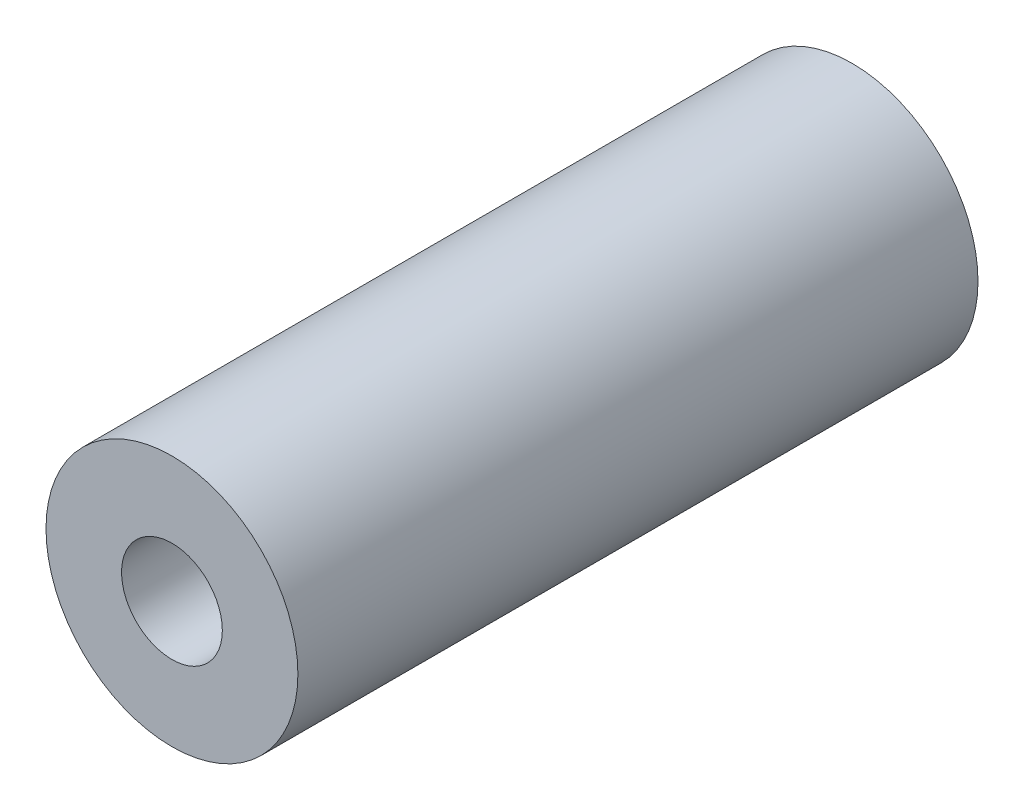
ISO-10303-21;
HEADER;
FILE_DESCRIPTION(('STEP AP214'),'2;1');
FILE_NAME('part.step','',(''),(''),'','','');
FILE_SCHEMA(('AUTOMOTIVE_DESIGN { 1 0 10303 214 1 1 1 1 }'));
ENDSEC;
DATA;
#1=APPLICATION_CONTEXT('core data for automotive mechanical design processes');
#2=APPLICATION_PROTOCOL_DEFINITION('international standard','automotive_design',2000,#1);
#3=PRODUCT_CONTEXT('',#1,'mechanical');
#4=PRODUCT('Part','Part','',(#3));
#5=PRODUCT_RELATED_PRODUCT_CATEGORY('part','',(#4));
#6=PRODUCT_DEFINITION_FORMATION('','',#4);
#7=PRODUCT_DEFINITION_CONTEXT('part definition',#1,'design');
#8=PRODUCT_DEFINITION('design','',#6,#7);
#9=PRODUCT_DEFINITION_SHAPE('','',#8);
#10=(LENGTH_UNIT() NAMED_UNIT(*) SI_UNIT(.MILLI.,.METRE.));
#11=(NAMED_UNIT(*) PLANE_ANGLE_UNIT() SI_UNIT($,.RADIAN.));
#12=(NAMED_UNIT(*) SI_UNIT($,.STERADIAN.) SOLID_ANGLE_UNIT());
#13=UNCERTAINTY_MEASURE_WITH_UNIT(LENGTH_MEASURE(1.E-05),#10,'distance_accuracy_value','');
#14=(GEOMETRIC_REPRESENTATION_CONTEXT(3) GLOBAL_UNCERTAINTY_ASSIGNED_CONTEXT((#13)) GLOBAL_UNIT_ASSIGNED_CONTEXT((#10,
#11,#12)) REPRESENTATION_CONTEXT('',''));
#15=CARTESIAN_POINT('',(0.,0.,0.));
#16=DIRECTION('',(0.,0.,1.));
#17=DIRECTION('',(1.,0.,0.));
#18=AXIS2_PLACEMENT_3D('',#15,#16,#17);
#19=CARTESIAN_POINT('',(0.,0.,54.));
#20=DIRECTION('',(0.,0.,-1.));
#21=DIRECTION('',(-1.,0.,0.));
#22=AXIS2_PLACEMENT_3D('',#19,#20,#21);
#23=CYLINDRICAL_SURFACE('',#22,10.);
#24=CARTESIAN_POINT('',(0.,0.,54.));
#25=DIRECTION('',(0.,0.,1.));
#26=DIRECTION('',(1.,0.,0.));
#27=AXIS2_PLACEMENT_3D('',#24,#25,#26);
#28=CIRCLE('',#27,10.);
#29=CARTESIAN_POINT('',(10.,0.,54.));
#30=VERTEX_POINT('',#29);
#31=EDGE_CURVE('E10',#30,#30,#28,.T.);
#32=ORIENTED_EDGE('',*,*,#31,.F.);
#33=EDGE_LOOP('',(#32));
#34=FACE_BOUND('',#33,.T.);
#35=CARTESIAN_POINT('',(0.,0.,0.));
#36=DIRECTION('',(0.,0.,1.));
#37=DIRECTION('',(1.,0.,0.));
#38=AXIS2_PLACEMENT_3D('',#35,#36,#37);
#39=CIRCLE('',#38,10.);
#40=CARTESIAN_POINT('',(10.,0.,0.));
#41=VERTEX_POINT('',#40);
#42=EDGE_CURVE('E40',#41,#41,#39,.T.);
#43=ORIENTED_EDGE('',*,*,#42,.T.);
#44=EDGE_LOOP('',(#43));
#45=FACE_BOUND('',#44,.T.);
#46=ADVANCED_FACE('F37',(#34,#45),#23,.T.);
#47=CARTESIAN_POINT('',(0.,0.,54.));
#48=DIRECTION('',(0.,0.,1.));
#49=DIRECTION('',(1.,0.,0.));
#50=AXIS2_PLACEMENT_3D('',#47,#48,#49);
#51=PLANE('',#50);
#52=CARTESIAN_POINT('',(0.,0.,54.));
#53=DIRECTION('',(0.,0.,1.));
#54=DIRECTION('',(1.,0.,0.));
#55=AXIS2_PLACEMENT_3D('',#52,#53,#54);
#56=CIRCLE('',#55,4.);
#57=CARTESIAN_POINT('',(4.,0.,54.));
#58=VERTEX_POINT('',#57);
#59=EDGE_CURVE('E51',#58,#58,#56,.T.);
#60=ORIENTED_EDGE('',*,*,#59,.F.);
#61=EDGE_LOOP('',(#60));
#62=FACE_BOUND('',#61,.T.);
#63=ORIENTED_EDGE('',*,*,#31,.T.);
#64=EDGE_LOOP('',(#63));
#65=FACE_BOUND('',#64,.T.);
#66=ADVANCED_FACE('F68',(#62,#65),#51,.T.);
#67=CARTESIAN_POINT('',(0.,0.,0.));
#68=DIRECTION('',(0.,0.,1.));
#69=DIRECTION('',(1.,0.,0.));
#70=AXIS2_PLACEMENT_3D('',#67,#68,#69);
#71=PLANE('',#70);
#72=CARTESIAN_POINT('',(0.,0.,0.));
#73=DIRECTION('',(0.,0.,1.));
#74=DIRECTION('',(1.,0.,0.));
#75=AXIS2_PLACEMENT_3D('',#72,#73,#74);
#76=CIRCLE('',#75,4.);
#77=CARTESIAN_POINT('',(4.,0.,0.));
#78=VERTEX_POINT('',#77);
#79=EDGE_CURVE('E49',#78,#78,#76,.T.);
#80=ORIENTED_EDGE('',*,*,#79,.T.);
#81=EDGE_LOOP('',(#80));
#82=FACE_BOUND('',#81,.T.);
#83=ORIENTED_EDGE('',*,*,#42,.F.);
#84=EDGE_LOOP('',(#83));
#85=FACE_BOUND('',#84,.T.);
#86=ADVANCED_FACE('F59',(#82,#85),#71,.F.);
#87=CARTESIAN_POINT('',(0.,0.,0.));
#88=DIRECTION('',(0.,0.,1.));
#89=DIRECTION('',(1.,0.,0.));
#90=AXIS2_PLACEMENT_3D('',#87,#88,#89);
#91=CYLINDRICAL_SURFACE('',#90,4.);
#92=ORIENTED_EDGE('',*,*,#79,.F.);
#93=EDGE_LOOP('',(#92));
#94=FACE_BOUND('',#93,.T.);
#95=ORIENTED_EDGE('',*,*,#59,.T.);
#96=EDGE_LOOP('',(#95));
#97=FACE_BOUND('',#96,.T.);
#98=ADVANCED_FACE('F62',(#94,#97),#91,.F.);
#99=CLOSED_SHELL('',(#46,#66,#86,#98));
#100=MANIFOLD_SOLID_BREP('B2',#99);
#101=ADVANCED_BREP_SHAPE_REPRESENTATION('',(#18,#100),#14);
#102=SHAPE_DEFINITION_REPRESENTATION(#9,#101);
ENDSEC;
END-ISO-10303-21;
